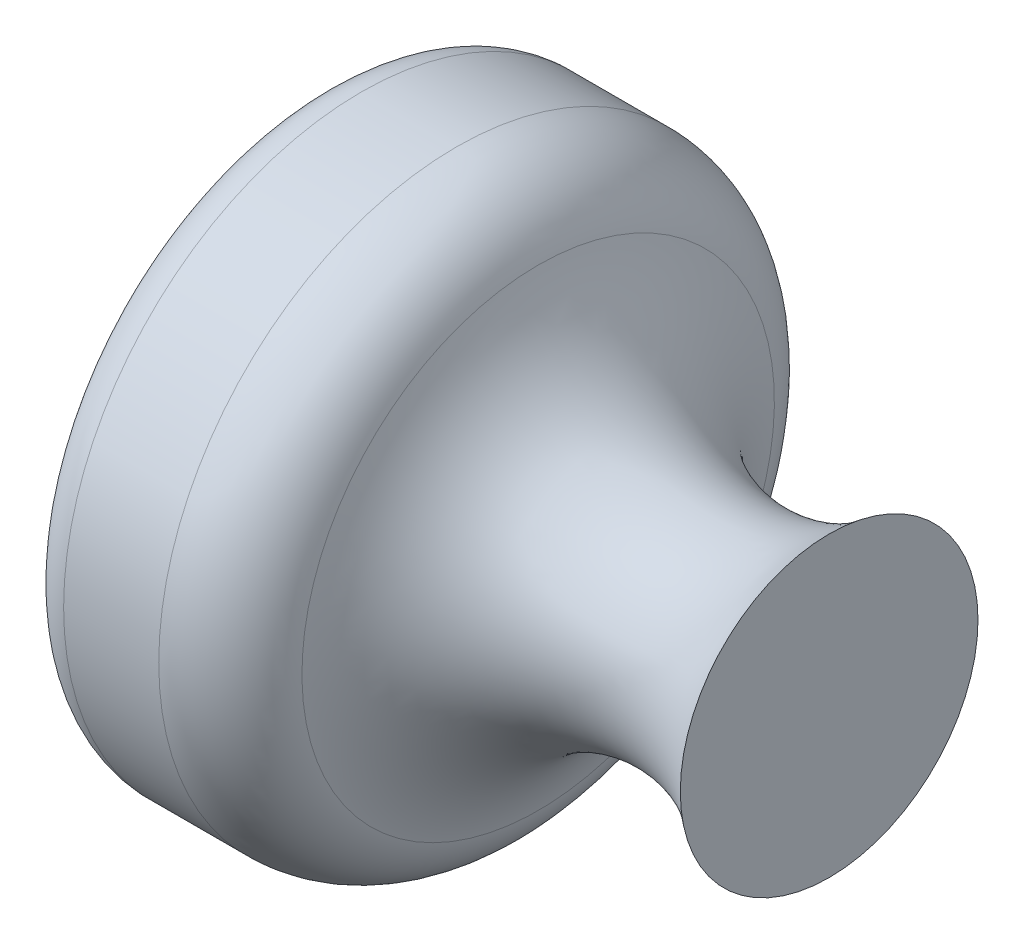
ISO-10303-21;
HEADER;
FILE_DESCRIPTION(('STEP AP214'),'2;1');
FILE_NAME('part.step','',(''),(''),'','','');
FILE_SCHEMA(('AUTOMOTIVE_DESIGN { 1 0 10303 214 1 1 1 1 }'));
ENDSEC;
DATA;
#1=APPLICATION_CONTEXT('core data for automotive mechanical design processes');
#2=APPLICATION_PROTOCOL_DEFINITION('international standard','automotive_design',2000,#1);
#3=PRODUCT_CONTEXT('',#1,'mechanical');
#4=PRODUCT('Part','Part','',(#3));
#5=PRODUCT_RELATED_PRODUCT_CATEGORY('part','',(#4));
#6=PRODUCT_DEFINITION_FORMATION('','',#4);
#7=PRODUCT_DEFINITION_CONTEXT('part definition',#1,'design');
#8=PRODUCT_DEFINITION('design','',#6,#7);
#9=PRODUCT_DEFINITION_SHAPE('','',#8);
#10=(LENGTH_UNIT() NAMED_UNIT(*) SI_UNIT(.MILLI.,.METRE.));
#11=(NAMED_UNIT(*) PLANE_ANGLE_UNIT() SI_UNIT($,.RADIAN.));
#12=(NAMED_UNIT(*) SI_UNIT($,.STERADIAN.) SOLID_ANGLE_UNIT());
#13=UNCERTAINTY_MEASURE_WITH_UNIT(LENGTH_MEASURE(1.E-05),#10,'distance_accuracy_value','');
#14=(GEOMETRIC_REPRESENTATION_CONTEXT(3) GLOBAL_UNCERTAINTY_ASSIGNED_CONTEXT((#13)) GLOBAL_UNIT_ASSIGNED_CONTEXT((#10,
#11,#12)) REPRESENTATION_CONTEXT('',''));
#15=CARTESIAN_POINT('',(0.,0.,0.));
#16=DIRECTION('',(0.,0.,1.));
#17=DIRECTION('',(1.,0.,0.));
#18=AXIS2_PLACEMENT_3D('',#15,#16,#17);
#19=CARTESIAN_POINT('',(-12.,0.,0.));
#20=DIRECTION('',(-1.,0.,0.));
#21=DIRECTION('',(0.,-1.,0.));
#22=AXIS2_PLACEMENT_3D('',#19,#20,#21);
#23=PLANE('',#22);
#24=CARTESIAN_POINT('',(-12.,0.,0.));
#25=DIRECTION('',(1.,0.,0.));
#26=DIRECTION('',(0.,1.,0.));
#27=AXIS2_PLACEMENT_3D('',#24,#25,#26);
#28=CIRCLE('',#27,6.);
#29=CARTESIAN_POINT('',(-12.,6.,0.));
#30=VERTEX_POINT('',#29);
#31=EDGE_CURVE('E10',#30,#30,#28,.T.);
#32=ORIENTED_EDGE('',*,*,#31,.F.);
#33=EDGE_LOOP('',(#32));
#34=FACE_BOUND('',#33,.T.);
#35=ADVANCED_FACE('F31',(#34),#23,.T.);
#36=CARTESIAN_POINT('',(-11.,0.,0.));
#37=DIRECTION('',(1.,0.,0.));
#38=DIRECTION('',(0.,1.,0.));
#39=AXIS2_PLACEMENT_3D('',#36,#37,#38);
#40=TOROIDAL_SURFACE('',#39,6.,1.);
#41=ORIENTED_EDGE('',*,*,#31,.T.);
#42=EDGE_LOOP('',(#41));
#43=FACE_BOUND('',#42,.T.);
#44=CARTESIAN_POINT('',(-11.,0.,0.));
#45=DIRECTION('',(1.,0.,0.));
#46=DIRECTION('',(0.,1.,0.));
#47=AXIS2_PLACEMENT_3D('',#44,#45,#46);
#48=CIRCLE('',#47,7.);
#49=CARTESIAN_POINT('',(-11.,7.,0.));
#50=VERTEX_POINT('',#49);
#51=EDGE_CURVE('E37',#50,#50,#48,.T.);
#52=ORIENTED_EDGE('',*,*,#51,.F.);
#53=EDGE_LOOP('',(#52));
#54=FACE_BOUND('',#53,.T.);
#55=ADVANCED_FACE('F70',(#43,#54),#40,.T.);
#56=CARTESIAN_POINT('',(0.,0.,0.));
#57=DIRECTION('',(1.,0.,0.));
#58=DIRECTION('',(0.,1.,0.));
#59=AXIS2_PLACEMENT_3D('',#56,#57,#58);
#60=CYLINDRICAL_SURFACE('',#59,7.);
#61=ORIENTED_EDGE('',*,*,#51,.T.);
#62=EDGE_LOOP('',(#61));
#63=FACE_BOUND('',#62,.T.);
#64=CARTESIAN_POINT('',(-8.7632431931333,0.,0.));
#65=DIRECTION('',(1.,0.,0.));
#66=DIRECTION('',(0.,1.,0.));
#67=AXIS2_PLACEMENT_3D('',#64,#65,#66);
#68=CIRCLE('',#67,7.);
#69=CARTESIAN_POINT('',(-8.7632431931333,7.,0.));
#70=VERTEX_POINT('',#69);
#71=EDGE_CURVE('E41',#70,#70,#68,.T.);
#72=ORIENTED_EDGE('',*,*,#71,.F.);
#73=EDGE_LOOP('',(#72));
#74=FACE_BOUND('',#73,.T.);
#75=ADVANCED_FACE('F66',(#63,#74),#60,.T.);
#76=CARTESIAN_POINT('',(-8.7632431931333,0.,0.));
#77=DIRECTION('',(1.,0.,0.));
#78=DIRECTION('',(0.,1.,0.));
#79=AXIS2_PLACEMENT_3D('',#76,#77,#78);
#80=TOROIDAL_SURFACE('',#79,5.,2.);
#81=ORIENTED_EDGE('',*,*,#71,.T.);
#82=EDGE_LOOP('',(#81));
#83=FACE_BOUND('',#82,.T.);
#84=CARTESIAN_POINT('',(-6.84168701974358,0.,0.));
#85=DIRECTION('',(1.,0.,0.));
#86=DIRECTION('',(0.,1.,0.));
#87=AXIS2_PLACEMENT_3D('',#84,#85,#86);
#88=CIRCLE('',#87,5.55463670317412);
#89=CARTESIAN_POINT('',(-6.84168701974359,5.55463670317412,0.));
#90=VERTEX_POINT('',#89);
#91=EDGE_CURVE('E45',#90,#90,#88,.T.);
#92=ORIENTED_EDGE('',*,*,#91,.F.);
#93=EDGE_LOOP('',(#92));
#94=FACE_BOUND('',#93,.T.);
#95=ADVANCED_FACE('F58',(#83,#94),#80,.T.);
#96=CARTESIAN_POINT('',(-2.75838015129043,0.,0.));
#97=DIRECTION('',(1.,0.,0.));
#98=DIRECTION('',(0.,1.,0.));
#99=AXIS2_PLACEMENT_3D('',#96,#97,#98);
#100=TOROIDAL_SURFACE('',#99,6.73323969741913,4.25);
#101=ORIENTED_EDGE('',*,*,#91,.T.);
#102=EDGE_LOOP('',(#101));
#103=FACE_BOUND('',#102,.T.);
#104=CARTESIAN_POINT('',(0.,0.,0.));
#105=DIRECTION('',(1.,0.,0.));
#106=DIRECTION('',(0.,1.,0.));
#107=AXIS2_PLACEMENT_3D('',#104,#105,#106);
#108=CIRCLE('',#107,3.5);
#109=CARTESIAN_POINT('',(0.,3.5,0.));
#110=VERTEX_POINT('',#109);
#111=EDGE_CURVE('E50',#110,#110,#108,.T.);
#112=ORIENTED_EDGE('',*,*,#111,.F.);
#113=EDGE_LOOP('',(#112));
#114=FACE_BOUND('',#113,.T.);
#115=ADVANCED_FACE('F56',(#103,#114),#100,.F.);
#116=CARTESIAN_POINT('',(0.,3.5,0.));
#117=DIRECTION('',(1.,0.,0.));
#118=DIRECTION('',(0.,1.,0.));
#119=AXIS2_PLACEMENT_3D('',#116,#117,#118);
#120=PLANE('',#119);
#121=ORIENTED_EDGE('',*,*,#111,.T.);
#122=EDGE_LOOP('',(#121));
#123=FACE_BOUND('',#122,.T.);
#124=ADVANCED_FACE('F54',(#123),#120,.T.);
#125=CLOSED_SHELL('',(#35,#55,#75,#95,#115,#124));
#126=MANIFOLD_SOLID_BREP('B2',#125);
#127=ADVANCED_BREP_SHAPE_REPRESENTATION('',(#18,#126),#14);
#128=SHAPE_DEFINITION_REPRESENTATION(#9,#127);
ENDSEC;
END-ISO-10303-21;
